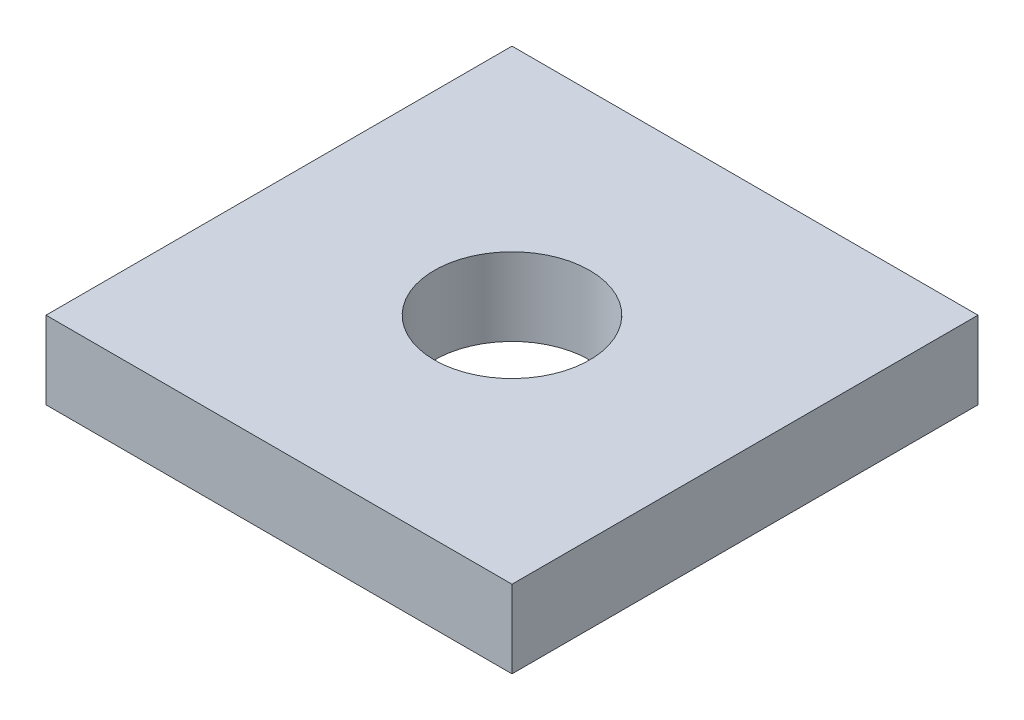
ISO-10303-21;
HEADER;
FILE_DESCRIPTION(('STEP AP214'),'2;1');
FILE_NAME('part.step','',(''),(''),'','','');
FILE_SCHEMA(('AUTOMOTIVE_DESIGN { 1 0 10303 214 1 1 1 1 }'));
ENDSEC;
DATA;
#1=APPLICATION_CONTEXT('core data for automotive mechanical design processes');
#2=APPLICATION_PROTOCOL_DEFINITION('international standard','automotive_design',2000,#1);
#3=PRODUCT_CONTEXT('',#1,'mechanical');
#4=PRODUCT('Part','Part','',(#3));
#5=PRODUCT_RELATED_PRODUCT_CATEGORY('part','',(#4));
#6=PRODUCT_DEFINITION_FORMATION('','',#4);
#7=PRODUCT_DEFINITION_CONTEXT('part definition',#1,'design');
#8=PRODUCT_DEFINITION('design','',#6,#7);
#9=PRODUCT_DEFINITION_SHAPE('','',#8);
#10=(LENGTH_UNIT() NAMED_UNIT(*) SI_UNIT(.MILLI.,.METRE.));
#11=(NAMED_UNIT(*) PLANE_ANGLE_UNIT() SI_UNIT($,.RADIAN.));
#12=(NAMED_UNIT(*) SI_UNIT($,.STERADIAN.) SOLID_ANGLE_UNIT());
#13=UNCERTAINTY_MEASURE_WITH_UNIT(LENGTH_MEASURE(1.E-05),#10,'distance_accuracy_value','');
#14=(GEOMETRIC_REPRESENTATION_CONTEXT(3) GLOBAL_UNCERTAINTY_ASSIGNED_CONTEXT((#13)) GLOBAL_UNIT_ASSIGNED_CONTEXT((#10,
#11,#12)) REPRESENTATION_CONTEXT('',''));
#15=CARTESIAN_POINT('',(0.,0.,0.));
#16=DIRECTION('',(0.,0.,1.));
#17=DIRECTION('',(1.,0.,0.));
#18=AXIS2_PLACEMENT_3D('',#15,#16,#17);
#19=CARTESIAN_POINT('',(0.,12.7,0.));
#20=DIRECTION('',(1.,0.,0.));
#21=DIRECTION('',(0.,0.,-1.));
#22=AXIS2_PLACEMENT_3D('',#19,#20,#21);
#23=PLANE('',#22);
#24=DIRECTION('',(0.,0.,1.));
#25=VECTOR('',#24,1.);
#26=CARTESIAN_POINT('',(0.,0.,0.));
#27=LINE('',#26,#25);
#28=CARTESIAN_POINT('',(0.,0.,-76.2));
#29=VERTEX_POINT('',#28);
#30=CARTESIAN_POINT('',(0.,0.,0.));
#31=VERTEX_POINT('',#30);
#32=EDGE_CURVE('E97',#29,#31,#27,.T.);
#33=ORIENTED_EDGE('',*,*,#32,.T.);
#34=DIRECTION('',(0.,-1.,0.));
#35=VECTOR('',#34,1.);
#36=CARTESIAN_POINT('',(0.,12.7,0.));
#37=LINE('',#36,#35);
#38=CARTESIAN_POINT('',(0.,12.7,0.));
#39=VERTEX_POINT('',#38);
#40=EDGE_CURVE('E11',#39,#31,#37,.T.);
#41=ORIENTED_EDGE('',*,*,#40,.F.);
#42=DIRECTION('',(0.,0.,1.));
#43=VECTOR('',#42,1.);
#44=CARTESIAN_POINT('',(0.,12.7,0.));
#45=LINE('',#44,#43);
#46=CARTESIAN_POINT('',(0.,12.7,-76.2));
#47=VERTEX_POINT('',#46);
#48=EDGE_CURVE('E85',#47,#39,#45,.T.);
#49=ORIENTED_EDGE('',*,*,#48,.F.);
#50=DIRECTION('',(0.,-1.,0.));
#51=VECTOR('',#50,1.);
#52=CARTESIAN_POINT('',(0.,12.7,-76.2));
#53=LINE('',#52,#51);
#54=EDGE_CURVE('E93',#47,#29,#53,.T.);
#55=ORIENTED_EDGE('',*,*,#54,.T.);
#56=EDGE_LOOP('',(#33,#41,#49,#55));
#57=FACE_BOUND('',#56,.T.);
#58=ADVANCED_FACE('F34',(#57),#23,.F.);
#59=CARTESIAN_POINT('',(0.,12.7,0.));
#60=DIRECTION('',(0.,0.,-1.));
#61=DIRECTION('',(-1.,0.,0.));
#62=AXIS2_PLACEMENT_3D('',#59,#60,#61);
#63=PLANE('',#62);
#64=DIRECTION('',(1.,0.,0.));
#65=VECTOR('',#64,1.);
#66=CARTESIAN_POINT('',(0.,0.,0.));
#67=LINE('',#66,#65);
#68=CARTESIAN_POINT('',(76.2,0.,0.));
#69=VERTEX_POINT('',#68);
#70=EDGE_CURVE('E89',#31,#69,#67,.T.);
#71=ORIENTED_EDGE('',*,*,#70,.T.);
#72=DIRECTION('',(0.,-1.,0.));
#73=VECTOR('',#72,1.);
#74=CARTESIAN_POINT('',(76.2,12.7,0.));
#75=LINE('',#74,#73);
#76=CARTESIAN_POINT('',(76.2,12.7,0.));
#77=VERTEX_POINT('',#76);
#78=EDGE_CURVE('E42',#77,#69,#75,.T.);
#79=ORIENTED_EDGE('',*,*,#78,.F.);
#80=DIRECTION('',(1.,0.,0.));
#81=VECTOR('',#80,1.);
#82=CARTESIAN_POINT('',(0.,12.7,0.));
#83=LINE('',#82,#81);
#84=EDGE_CURVE('E80',#39,#77,#83,.T.);
#85=ORIENTED_EDGE('',*,*,#84,.F.);
#86=ORIENTED_EDGE('',*,*,#40,.T.);
#87=EDGE_LOOP('',(#71,#79,#85,#86));
#88=FACE_BOUND('',#87,.T.);
#89=ADVANCED_FACE('F88',(#88),#63,.F.);
#90=CARTESIAN_POINT('',(76.2,12.7,0.));
#91=DIRECTION('',(-1.,0.,0.));
#92=DIRECTION('',(0.,0.,1.));
#93=AXIS2_PLACEMENT_3D('',#90,#91,#92);
#94=PLANE('',#93);
#95=DIRECTION('',(0.,0.,-1.));
#96=VECTOR('',#95,1.);
#97=CARTESIAN_POINT('',(76.2,0.,0.));
#98=LINE('',#97,#96);
#99=CARTESIAN_POINT('',(76.2,0.,-76.2));
#100=VERTEX_POINT('',#99);
#101=EDGE_CURVE('E67',#69,#100,#98,.T.);
#102=ORIENTED_EDGE('',*,*,#101,.T.);
#103=DIRECTION('',(0.,-1.,0.));
#104=VECTOR('',#103,1.);
#105=CARTESIAN_POINT('',(76.2,12.7,-76.2));
#106=LINE('',#105,#104);
#107=CARTESIAN_POINT('',(76.2,12.7,-76.2));
#108=VERTEX_POINT('',#107);
#109=EDGE_CURVE('E90',#108,#100,#106,.T.);
#110=ORIENTED_EDGE('',*,*,#109,.F.);
#111=DIRECTION('',(0.,0.,-1.));
#112=VECTOR('',#111,1.);
#113=CARTESIAN_POINT('',(76.2,12.7,0.));
#114=LINE('',#113,#112);
#115=EDGE_CURVE('E83',#77,#108,#114,.T.);
#116=ORIENTED_EDGE('',*,*,#115,.F.);
#117=ORIENTED_EDGE('',*,*,#78,.T.);
#118=EDGE_LOOP('',(#102,#110,#116,#117));
#119=FACE_BOUND('',#118,.T.);
#120=ADVANCED_FACE('F91',(#119),#94,.F.);
#121=CARTESIAN_POINT('',(0.,12.7,-76.2));
#122=DIRECTION('',(0.,0.,1.));
#123=DIRECTION('',(1.,0.,0.));
#124=AXIS2_PLACEMENT_3D('',#121,#122,#123);
#125=PLANE('',#124);
#126=DIRECTION('',(-1.,0.,0.));
#127=VECTOR('',#126,1.);
#128=CARTESIAN_POINT('',(0.,0.,-76.2));
#129=LINE('',#128,#127);
#130=EDGE_CURVE('E73',#100,#29,#129,.T.);
#131=ORIENTED_EDGE('',*,*,#130,.T.);
#132=ORIENTED_EDGE('',*,*,#54,.F.);
#133=DIRECTION('',(-1.,0.,0.));
#134=VECTOR('',#133,1.);
#135=CARTESIAN_POINT('',(0.,12.7,-76.2));
#136=LINE('',#135,#134);
#137=EDGE_CURVE('E50',#108,#47,#136,.T.);
#138=ORIENTED_EDGE('',*,*,#137,.F.);
#139=ORIENTED_EDGE('',*,*,#109,.T.);
#140=EDGE_LOOP('',(#131,#132,#138,#139));
#141=FACE_BOUND('',#140,.T.);
#142=ADVANCED_FACE('F105',(#141),#125,.F.);
#143=CARTESIAN_POINT('',(0.,12.7,-76.2));
#144=DIRECTION('',(0.,-1.,0.));
#145=DIRECTION('',(0.,0.,-1.));
#146=AXIS2_PLACEMENT_3D('',#143,#144,#145);
#147=PLANE('',#146);
#148=CARTESIAN_POINT('',(38.1,12.7,-38.1));
#149=DIRECTION('',(0.,1.,0.));
#150=DIRECTION('',(0.,0.,1.));
#151=AXIS2_PLACEMENT_3D('',#148,#149,#150);
#152=CIRCLE('',#151,12.7);
#153=CARTESIAN_POINT('',(38.1,12.7,-25.4));
#154=VERTEX_POINT('',#153);
#155=EDGE_CURVE('E100',#154,#154,#152,.T.);
#156=ORIENTED_EDGE('',*,*,#155,.F.);
#157=EDGE_LOOP('',(#156));
#158=FACE_BOUND('',#157,.T.);
#159=ORIENTED_EDGE('',*,*,#48,.T.);
#160=ORIENTED_EDGE('',*,*,#84,.T.);
#161=ORIENTED_EDGE('',*,*,#115,.T.);
#162=ORIENTED_EDGE('',*,*,#137,.T.);
#163=EDGE_LOOP('',(#159,#160,#161,#162));
#164=FACE_BOUND('',#163,.T.);
#165=ADVANCED_FACE('F81',(#158,#164),#147,.F.);
#166=CARTESIAN_POINT('',(0.,0.,-76.2));
#167=DIRECTION('',(0.,-1.,0.));
#168=DIRECTION('',(0.,0.,-1.));
#169=AXIS2_PLACEMENT_3D('',#166,#167,#168);
#170=PLANE('',#169);
#171=CARTESIAN_POINT('',(38.1,0.,-38.1));
#172=DIRECTION('',(0.,-1.,0.));
#173=DIRECTION('',(0.,0.,-1.));
#174=AXIS2_PLACEMENT_3D('',#171,#172,#173);
#175=CIRCLE('',#174,12.7);
#176=CARTESIAN_POINT('',(38.1,0.,-50.8));
#177=VERTEX_POINT('',#176);
#178=EDGE_CURVE('E111',#177,#177,#175,.F.);
#179=ORIENTED_EDGE('',*,*,#178,.T.);
#180=EDGE_LOOP('',(#179));
#181=FACE_BOUND('',#180,.T.);
#182=ORIENTED_EDGE('',*,*,#32,.F.);
#183=ORIENTED_EDGE('',*,*,#130,.F.);
#184=ORIENTED_EDGE('',*,*,#101,.F.);
#185=ORIENTED_EDGE('',*,*,#70,.F.);
#186=EDGE_LOOP('',(#182,#183,#184,#185));
#187=FACE_BOUND('',#186,.T.);
#188=ADVANCED_FACE('F108',(#181,#187),#170,.T.);
#189=CARTESIAN_POINT('',(38.1,-0.000999999999999265,-38.1));
#190=DIRECTION('',(0.,1.,0.));
#191=DIRECTION('',(0.,0.,1.));
#192=AXIS2_PLACEMENT_3D('',#189,#190,#191);
#193=CYLINDRICAL_SURFACE('',#192,12.7);
#194=ORIENTED_EDGE('',*,*,#178,.F.);
#195=EDGE_LOOP('',(#194));
#196=FACE_BOUND('',#195,.T.);
#197=ORIENTED_EDGE('',*,*,#155,.T.);
#198=EDGE_LOOP('',(#197));
#199=FACE_BOUND('',#198,.T.);
#200=ADVANCED_FACE('F117',(#196,#199),#193,.F.);
#201=CLOSED_SHELL('',(#58,#89,#120,#142,#165,#188,#200));
#202=MANIFOLD_SOLID_BREP('B2',#201);
#203=ADVANCED_BREP_SHAPE_REPRESENTATION('',(#18,#202),#14);
#204=SHAPE_DEFINITION_REPRESENTATION(#9,#203);
ENDSEC;
END-ISO-10303-21;
